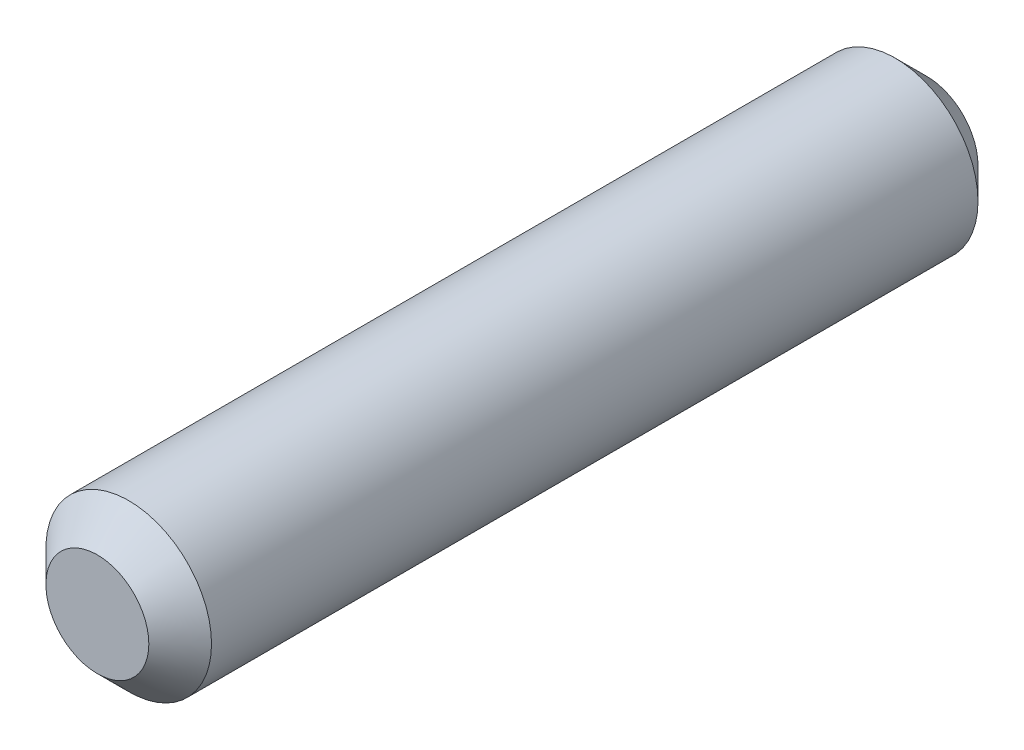
ISO-10303-21;
HEADER;
FILE_DESCRIPTION(('STEP AP214'),'2;1');
FILE_NAME('part.step','',(''),(''),'','','');
FILE_SCHEMA(('AUTOMOTIVE_DESIGN { 1 0 10303 214 1 1 1 1 }'));
ENDSEC;
DATA;
#1=APPLICATION_CONTEXT('core data for automotive mechanical design processes');
#2=APPLICATION_PROTOCOL_DEFINITION('international standard','automotive_design',2000,#1);
#3=PRODUCT_CONTEXT('',#1,'mechanical');
#4=PRODUCT('Part','Part','',(#3));
#5=PRODUCT_RELATED_PRODUCT_CATEGORY('part','',(#4));
#6=PRODUCT_DEFINITION_FORMATION('','',#4);
#7=PRODUCT_DEFINITION_CONTEXT('part definition',#1,'design');
#8=PRODUCT_DEFINITION('design','',#6,#7);
#9=PRODUCT_DEFINITION_SHAPE('','',#8);
#10=(LENGTH_UNIT() NAMED_UNIT(*) SI_UNIT(.MILLI.,.METRE.));
#11=(NAMED_UNIT(*) PLANE_ANGLE_UNIT() SI_UNIT($,.RADIAN.));
#12=(NAMED_UNIT(*) SI_UNIT($,.STERADIAN.) SOLID_ANGLE_UNIT());
#13=UNCERTAINTY_MEASURE_WITH_UNIT(LENGTH_MEASURE(1.E-05),#10,'distance_accuracy_value','');
#14=(GEOMETRIC_REPRESENTATION_CONTEXT(3) GLOBAL_UNCERTAINTY_ASSIGNED_CONTEXT((#13)) GLOBAL_UNIT_ASSIGNED_CONTEXT((#10,
#11,#12)) REPRESENTATION_CONTEXT('',''));
#15=CARTESIAN_POINT('',(0.,0.,0.));
#16=DIRECTION('',(0.,0.,1.));
#17=DIRECTION('',(1.,0.,0.));
#18=AXIS2_PLACEMENT_3D('',#15,#16,#17);
#19=CARTESIAN_POINT('',(0.,0.,7.935));
#20=DIRECTION('',(0.,0.,-1.));
#21=DIRECTION('',(-1.,0.,0.));
#22=AXIS2_PLACEMENT_3D('',#19,#20,#21);
#23=CYLINDRICAL_SURFACE('',#22,1.585);
#24=CARTESIAN_POINT('',(0.,0.,-7.335));
#25=DIRECTION('',(0.,0.,1.));
#26=DIRECTION('',(1.,0.,0.));
#27=AXIS2_PLACEMENT_3D('',#24,#25,#26);
#28=CIRCLE('',#27,1.585);
#29=CARTESIAN_POINT('',(1.585,0.,-7.335));
#30=VERTEX_POINT('',#29);
#31=EDGE_CURVE('E59',#30,#30,#28,.T.);
#32=ORIENTED_EDGE('',*,*,#31,.T.);
#33=EDGE_LOOP('',(#32));
#34=FACE_BOUND('',#33,.T.);
#35=CARTESIAN_POINT('',(0.,0.,7.335));
#36=DIRECTION('',(0.,0.,1.));
#37=DIRECTION('',(1.,0.,0.));
#38=AXIS2_PLACEMENT_3D('',#35,#36,#37);
#39=CIRCLE('',#38,1.585);
#40=CARTESIAN_POINT('',(1.585,0.,7.335));
#41=VERTEX_POINT('',#40);
#42=EDGE_CURVE('E64',#41,#41,#39,.F.);
#43=ORIENTED_EDGE('',*,*,#42,.T.);
#44=EDGE_LOOP('',(#43));
#45=FACE_BOUND('',#44,.T.);
#46=ADVANCED_FACE('F45',(#34,#45),#23,.T.);
#47=CARTESIAN_POINT('',(0.,0.,7.935));
#48=DIRECTION('',(0.,0.,1.));
#49=DIRECTION('',(1.,0.,0.));
#50=AXIS2_PLACEMENT_3D('',#47,#48,#49);
#51=PLANE('',#50);
#52=CARTESIAN_POINT('',(0.,0.,7.935));
#53=DIRECTION('',(0.,0.,1.));
#54=DIRECTION('',(1.,0.,0.));
#55=AXIS2_PLACEMENT_3D('',#52,#53,#54);
#56=CIRCLE('',#55,0.984999999999998);
#57=CARTESIAN_POINT('',(0.984999999999998,0.,7.935));
#58=VERTEX_POINT('',#57);
#59=EDGE_CURVE('E10',#58,#58,#56,.T.);
#60=ORIENTED_EDGE('',*,*,#59,.T.);
#61=EDGE_LOOP('',(#60));
#62=FACE_BOUND('',#61,.T.);
#63=ADVANCED_FACE('F81',(#62),#51,.T.);
#64=CARTESIAN_POINT('',(0.,0.,-7.935));
#65=DIRECTION('',(0.,0.,1.));
#66=DIRECTION('',(1.,0.,0.));
#67=AXIS2_PLACEMENT_3D('',#64,#65,#66);
#68=PLANE('',#67);
#69=CARTESIAN_POINT('',(0.,0.,-7.935));
#70=DIRECTION('',(0.,0.,1.));
#71=DIRECTION('',(1.,0.,0.));
#72=AXIS2_PLACEMENT_3D('',#69,#70,#71);
#73=CIRCLE('',#72,0.984999999999998);
#74=CARTESIAN_POINT('',(0.984999999999998,0.,-7.935));
#75=VERTEX_POINT('',#74);
#76=EDGE_CURVE('E54',#75,#75,#73,.F.);
#77=ORIENTED_EDGE('',*,*,#76,.T.);
#78=EDGE_LOOP('',(#77));
#79=FACE_BOUND('',#78,.T.);
#80=ADVANCED_FACE('F78',(#79),#68,.F.);
#81=CARTESIAN_POINT('',(0.,0.,-7.335));
#82=DIRECTION('',(0.,0.,1.));
#83=DIRECTION('',(1.,0.,0.));
#84=AXIS2_PLACEMENT_3D('',#81,#82,#83);
#85=CONICAL_SURFACE('',#84,1.585,0.785398163397449);
#86=ORIENTED_EDGE('',*,*,#76,.F.);
#87=EDGE_LOOP('',(#86));
#88=FACE_BOUND('',#87,.T.);
#89=ORIENTED_EDGE('',*,*,#31,.F.);
#90=EDGE_LOOP('',(#89));
#91=FACE_BOUND('',#90,.T.);
#92=ADVANCED_FACE('F74',(#88,#91),#85,.T.);
#93=CARTESIAN_POINT('',(0.,0.,7.935));
#94=DIRECTION('',(0.,0.,-1.));
#95=DIRECTION('',(-1.,0.,0.));
#96=AXIS2_PLACEMENT_3D('',#93,#94,#95);
#97=CONICAL_SURFACE('',#96,0.984999999999998,0.785398163397448);
#98=ORIENTED_EDGE('',*,*,#42,.F.);
#99=EDGE_LOOP('',(#98));
#100=FACE_BOUND('',#99,.T.);
#101=ORIENTED_EDGE('',*,*,#59,.F.);
#102=EDGE_LOOP('',(#101));
#103=FACE_BOUND('',#102,.T.);
#104=ADVANCED_FACE('F48',(#100,#103),#97,.T.);
#105=CLOSED_SHELL('',(#46,#63,#80,#92,#104));
#106=MANIFOLD_SOLID_BREP('B2',#105);
#107=ADVANCED_BREP_SHAPE_REPRESENTATION('',(#18,#106),#14);
#108=SHAPE_DEFINITION_REPRESENTATION(#9,#107);
ENDSEC;
END-ISO-10303-21;
